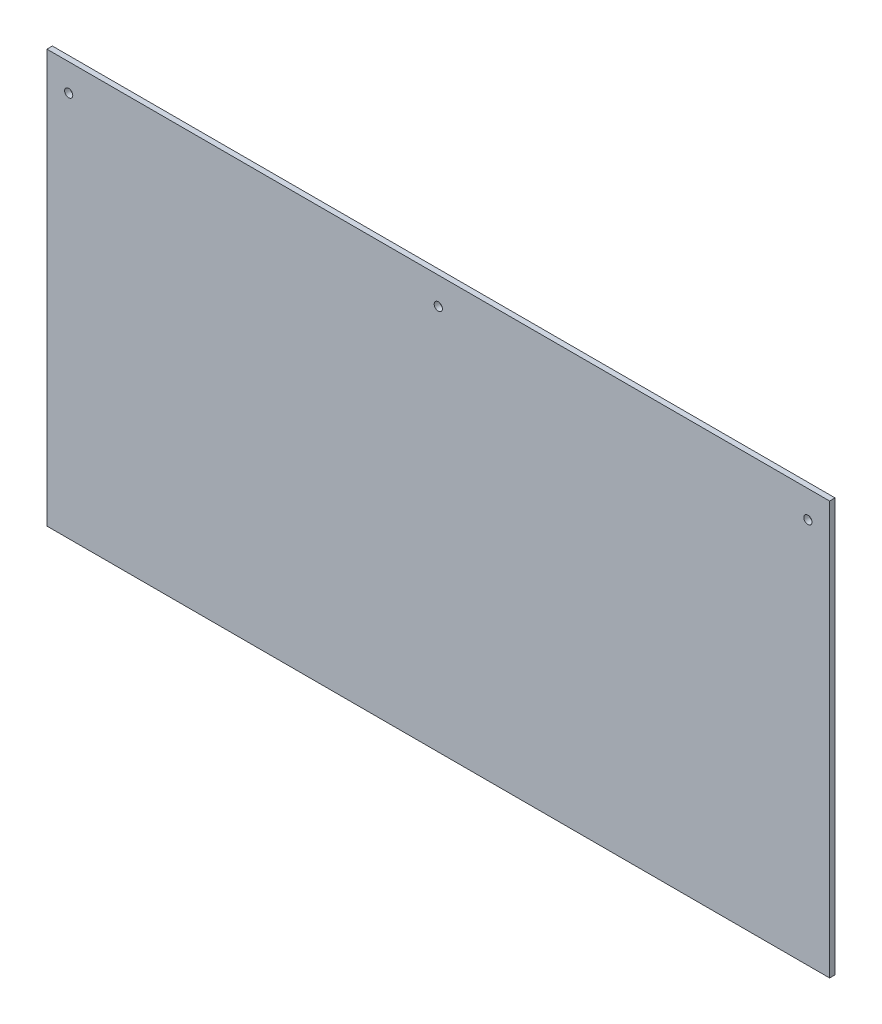
ISO-10303-21;
HEADER;
FILE_DESCRIPTION(('STEP AP214'),'2;1');
FILE_NAME('part.step','',(''),(''),'','','');
FILE_SCHEMA(('AUTOMOTIVE_DESIGN { 1 0 10303 214 1 1 1 1 }'));
ENDSEC;
DATA;
#1=APPLICATION_CONTEXT('core data for automotive mechanical design processes');
#2=APPLICATION_PROTOCOL_DEFINITION('international standard','automotive_design',2000,#1);
#3=PRODUCT_CONTEXT('',#1,'mechanical');
#4=PRODUCT('Part','Part','',(#3));
#5=PRODUCT_RELATED_PRODUCT_CATEGORY('part','',(#4));
#6=PRODUCT_DEFINITION_FORMATION('','',#4);
#7=PRODUCT_DEFINITION_CONTEXT('part definition',#1,'design');
#8=PRODUCT_DEFINITION('design','',#6,#7);
#9=PRODUCT_DEFINITION_SHAPE('','',#8);
#10=(LENGTH_UNIT() NAMED_UNIT(*) SI_UNIT(.MILLI.,.METRE.));
#11=(NAMED_UNIT(*) PLANE_ANGLE_UNIT() SI_UNIT($,.RADIAN.));
#12=(NAMED_UNIT(*) SI_UNIT($,.STERADIAN.) SOLID_ANGLE_UNIT());
#13=UNCERTAINTY_MEASURE_WITH_UNIT(LENGTH_MEASURE(1.E-05),#10,'distance_accuracy_value','');
#14=(GEOMETRIC_REPRESENTATION_CONTEXT(3) GLOBAL_UNCERTAINTY_ASSIGNED_CONTEXT((#13)) GLOBAL_UNIT_ASSIGNED_CONTEXT((#10,
#11,#12)) REPRESENTATION_CONTEXT('',''));
#15=CARTESIAN_POINT('',(0.,0.,0.));
#16=DIRECTION('',(0.,0.,1.));
#17=DIRECTION('',(1.,0.,0.));
#18=AXIS2_PLACEMENT_3D('',#15,#16,#17);
#19=CARTESIAN_POINT('',(889.,450.85,0.));
#20=DIRECTION('',(0.,0.,1.));
#21=DIRECTION('',(1.,0.,0.));
#22=AXIS2_PLACEMENT_3D('',#19,#20,#21);
#23=CYLINDRICAL_SURFACE('',#22,4.7625);
#24=CARTESIAN_POINT('',(889.,450.85,0.));
#25=DIRECTION('',(0.,0.,1.));
#26=DIRECTION('',(1.,0.,0.));
#27=AXIS2_PLACEMENT_3D('',#24,#25,#26);
#28=CIRCLE('',#27,4.7625);
#29=CARTESIAN_POINT('',(893.7625,450.85,0.));
#30=VERTEX_POINT('',#29);
#31=EDGE_CURVE('E40',#30,#30,#28,.T.);
#32=ORIENTED_EDGE('',*,*,#31,.F.);
#33=EDGE_LOOP('',(#32));
#34=FACE_BOUND('',#33,.T.);
#35=CARTESIAN_POINT('',(889.,450.85,6.35));
#36=DIRECTION('',(0.,0.,1.));
#37=DIRECTION('',(1.,0.,0.));
#38=AXIS2_PLACEMENT_3D('',#35,#36,#37);
#39=CIRCLE('',#38,4.7625);
#40=CARTESIAN_POINT('',(893.7625,450.85,6.35));
#41=VERTEX_POINT('',#40);
#42=EDGE_CURVE('E11',#41,#41,#39,.T.);
#43=ORIENTED_EDGE('',*,*,#42,.T.);
#44=EDGE_LOOP('',(#43));
#45=FACE_BOUND('',#44,.T.);
#46=ADVANCED_FACE('F32',(#34,#45),#23,.F.);
#47=CARTESIAN_POINT('',(0.,0.,6.35));
#48=DIRECTION('',(1.,0.,0.));
#49=DIRECTION('',(0.,0.,-1.));
#50=AXIS2_PLACEMENT_3D('',#47,#48,#49);
#51=PLANE('',#50);
#52=DIRECTION('',(0.,-1.,0.));
#53=VECTOR('',#52,1.);
#54=CARTESIAN_POINT('',(0.,0.,0.));
#55=LINE('',#54,#53);
#56=CARTESIAN_POINT('',(0.,482.6,0.));
#57=VERTEX_POINT('',#56);
#58=CARTESIAN_POINT('',(0.,0.,0.));
#59=VERTEX_POINT('',#58);
#60=EDGE_CURVE('E100',#57,#59,#55,.T.);
#61=ORIENTED_EDGE('',*,*,#60,.T.);
#62=DIRECTION('',(0.,0.,-1.));
#63=VECTOR('',#62,1.);
#64=CARTESIAN_POINT('',(0.,0.,6.35));
#65=LINE('',#64,#63);
#66=CARTESIAN_POINT('',(0.,0.,6.35));
#67=VERTEX_POINT('',#66);
#68=EDGE_CURVE('E91',#67,#59,#65,.T.);
#69=ORIENTED_EDGE('',*,*,#68,.F.);
#70=DIRECTION('',(0.,-1.,0.));
#71=VECTOR('',#70,1.);
#72=CARTESIAN_POINT('',(0.,0.,6.35));
#73=LINE('',#72,#71);
#74=CARTESIAN_POINT('',(0.,482.6,6.35));
#75=VERTEX_POINT('',#74);
#76=EDGE_CURVE('E85',#75,#67,#73,.T.);
#77=ORIENTED_EDGE('',*,*,#76,.F.);
#78=DIRECTION('',(0.,0.,-1.));
#79=VECTOR('',#78,1.);
#80=CARTESIAN_POINT('',(0.,482.6,6.35));
#81=LINE('',#80,#79);
#82=EDGE_CURVE('E96',#75,#57,#81,.T.);
#83=ORIENTED_EDGE('',*,*,#82,.T.);
#84=EDGE_LOOP('',(#61,#69,#77,#83));
#85=FACE_BOUND('',#84,.T.);
#86=ADVANCED_FACE('F116',(#85),#51,.F.);
#87=CARTESIAN_POINT('',(0.,0.,6.35));
#88=DIRECTION('',(0.,1.,0.));
#89=DIRECTION('',(0.,0.,1.));
#90=AXIS2_PLACEMENT_3D('',#87,#88,#89);
#91=PLANE('',#90);
#92=DIRECTION('',(1.,0.,0.));
#93=VECTOR('',#92,1.);
#94=CARTESIAN_POINT('',(0.,0.,0.));
#95=LINE('',#94,#93);
#96=CARTESIAN_POINT('',(914.4,0.,0.));
#97=VERTEX_POINT('',#96);
#98=EDGE_CURVE('E90',#59,#97,#95,.T.);
#99=ORIENTED_EDGE('',*,*,#98,.T.);
#100=DIRECTION('',(0.,0.,-1.));
#101=VECTOR('',#100,1.);
#102=CARTESIAN_POINT('',(914.4,0.,6.35));
#103=LINE('',#102,#101);
#104=CARTESIAN_POINT('',(914.4,0.,6.35));
#105=VERTEX_POINT('',#104);
#106=EDGE_CURVE('E88',#105,#97,#103,.T.);
#107=ORIENTED_EDGE('',*,*,#106,.F.);
#108=DIRECTION('',(1.,0.,0.));
#109=VECTOR('',#108,1.);
#110=CARTESIAN_POINT('',(0.,0.,6.35));
#111=LINE('',#110,#109);
#112=EDGE_CURVE('E79',#67,#105,#111,.T.);
#113=ORIENTED_EDGE('',*,*,#112,.F.);
#114=ORIENTED_EDGE('',*,*,#68,.T.);
#115=EDGE_LOOP('',(#99,#107,#113,#114));
#116=FACE_BOUND('',#115,.T.);
#117=ADVANCED_FACE('F89',(#116),#91,.F.);
#118=CARTESIAN_POINT('',(914.4,0.,6.35));
#119=DIRECTION('',(-1.,0.,0.));
#120=DIRECTION('',(0.,0.,1.));
#121=AXIS2_PLACEMENT_3D('',#118,#119,#120);
#122=PLANE('',#121);
#123=DIRECTION('',(0.,1.,0.));
#124=VECTOR('',#123,1.);
#125=CARTESIAN_POINT('',(914.4,0.,0.));
#126=LINE('',#125,#124);
#127=CARTESIAN_POINT('',(914.4,482.6,0.));
#128=VERTEX_POINT('',#127);
#129=EDGE_CURVE('E65',#97,#128,#126,.T.);
#130=ORIENTED_EDGE('',*,*,#129,.T.);
#131=DIRECTION('',(0.,0.,-1.));
#132=VECTOR('',#131,1.);
#133=CARTESIAN_POINT('',(914.4,482.6,6.35));
#134=LINE('',#133,#132);
#135=CARTESIAN_POINT('',(914.4,482.6,6.35));
#136=VERTEX_POINT('',#135);
#137=EDGE_CURVE('E92',#136,#128,#134,.T.);
#138=ORIENTED_EDGE('',*,*,#137,.F.);
#139=DIRECTION('',(0.,1.,0.));
#140=VECTOR('',#139,1.);
#141=CARTESIAN_POINT('',(914.4,0.,6.35));
#142=LINE('',#141,#140);
#143=EDGE_CURVE('E83',#105,#136,#142,.T.);
#144=ORIENTED_EDGE('',*,*,#143,.F.);
#145=ORIENTED_EDGE('',*,*,#106,.T.);
#146=EDGE_LOOP('',(#130,#138,#144,#145));
#147=FACE_BOUND('',#146,.T.);
#148=ADVANCED_FACE('F94',(#147),#122,.F.);
#149=CARTESIAN_POINT('',(0.,482.6,6.35));
#150=DIRECTION('',(0.,-1.,0.));
#151=DIRECTION('',(1.,0.,0.));
#152=AXIS2_PLACEMENT_3D('',#149,#150,#151);
#153=PLANE('',#152);
#154=DIRECTION('',(-1.,0.,0.));
#155=VECTOR('',#154,1.);
#156=CARTESIAN_POINT('',(0.,482.6,0.));
#157=LINE('',#156,#155);
#158=EDGE_CURVE('E71',#128,#57,#157,.T.);
#159=ORIENTED_EDGE('',*,*,#158,.T.);
#160=ORIENTED_EDGE('',*,*,#82,.F.);
#161=DIRECTION('',(-1.,0.,0.));
#162=VECTOR('',#161,1.);
#163=CARTESIAN_POINT('',(0.,482.6,6.35));
#164=LINE('',#163,#162);
#165=EDGE_CURVE('E48',#136,#75,#164,.T.);
#166=ORIENTED_EDGE('',*,*,#165,.F.);
#167=ORIENTED_EDGE('',*,*,#137,.T.);
#168=EDGE_LOOP('',(#159,#160,#166,#167));
#169=FACE_BOUND('',#168,.T.);
#170=ADVANCED_FACE('F119',(#169),#153,.F.);
#171=CARTESIAN_POINT('',(0.,0.,6.35));
#172=DIRECTION('',(0.,0.,-1.));
#173=DIRECTION('',(-1.,0.,0.));
#174=AXIS2_PLACEMENT_3D('',#171,#172,#173);
#175=PLANE('',#174);
#176=CARTESIAN_POINT('',(457.2,450.85,6.35));
#177=DIRECTION('',(0.,0.,1.));
#178=DIRECTION('',(1.,0.,0.));
#179=AXIS2_PLACEMENT_3D('',#176,#177,#178);
#180=CIRCLE('',#179,4.7625);
#181=CARTESIAN_POINT('',(461.9625,450.85,6.35));
#182=VERTEX_POINT('',#181);
#183=EDGE_CURVE('E148',#182,#182,#180,.T.);
#184=ORIENTED_EDGE('',*,*,#183,.F.);
#185=EDGE_LOOP('',(#184));
#186=FACE_BOUND('',#185,.T.);
#187=CARTESIAN_POINT('',(25.4,450.85,6.35));
#188=DIRECTION('',(0.,0.,1.));
#189=DIRECTION('',(1.,0.,0.));
#190=AXIS2_PLACEMENT_3D('',#187,#188,#189);
#191=CIRCLE('',#190,4.7625);
#192=CARTESIAN_POINT('',(30.1625,450.85,6.35));
#193=VERTEX_POINT('',#192);
#194=EDGE_CURVE('E145',#193,#193,#191,.T.);
#195=ORIENTED_EDGE('',*,*,#194,.F.);
#196=EDGE_LOOP('',(#195));
#197=FACE_BOUND('',#196,.T.);
#198=ORIENTED_EDGE('',*,*,#76,.T.);
#199=ORIENTED_EDGE('',*,*,#112,.T.);
#200=ORIENTED_EDGE('',*,*,#143,.T.);
#201=ORIENTED_EDGE('',*,*,#165,.T.);
#202=EDGE_LOOP('',(#198,#199,#200,#201));
#203=FACE_BOUND('',#202,.T.);
#204=ORIENTED_EDGE('',*,*,#42,.F.);
#205=EDGE_LOOP('',(#204));
#206=FACE_BOUND('',#205,.T.);
#207=ADVANCED_FACE('F80',(#186,#197,#203,#206),#175,.F.);
#208=CARTESIAN_POINT('',(0.,0.,0.));
#209=DIRECTION('',(0.,0.,-1.));
#210=DIRECTION('',(-1.,0.,0.));
#211=AXIS2_PLACEMENT_3D('',#208,#209,#210);
#212=PLANE('',#211);
#213=CARTESIAN_POINT('',(457.2,450.85,0.));
#214=DIRECTION('',(0.,0.,1.));
#215=DIRECTION('',(1.,0.,0.));
#216=AXIS2_PLACEMENT_3D('',#213,#214,#215);
#217=CIRCLE('',#216,4.7625);
#218=CARTESIAN_POINT('',(461.9625,450.85,0.));
#219=VERTEX_POINT('',#218);
#220=EDGE_CURVE('E153',#219,#219,#217,.T.);
#221=ORIENTED_EDGE('',*,*,#220,.T.);
#222=EDGE_LOOP('',(#221));
#223=FACE_BOUND('',#222,.T.);
#224=CARTESIAN_POINT('',(25.4,450.85,0.));
#225=DIRECTION('',(0.,0.,1.));
#226=DIRECTION('',(1.,0.,0.));
#227=AXIS2_PLACEMENT_3D('',#224,#225,#226);
#228=CIRCLE('',#227,4.7625);
#229=CARTESIAN_POINT('',(30.1625,450.85,0.));
#230=VERTEX_POINT('',#229);
#231=EDGE_CURVE('E103',#230,#230,#228,.T.);
#232=ORIENTED_EDGE('',*,*,#231,.T.);
#233=EDGE_LOOP('',(#232));
#234=FACE_BOUND('',#233,.T.);
#235=ORIENTED_EDGE('',*,*,#60,.F.);
#236=ORIENTED_EDGE('',*,*,#158,.F.);
#237=ORIENTED_EDGE('',*,*,#129,.F.);
#238=ORIENTED_EDGE('',*,*,#98,.F.);
#239=EDGE_LOOP('',(#235,#236,#237,#238));
#240=FACE_BOUND('',#239,.T.);
#241=ORIENTED_EDGE('',*,*,#31,.T.);
#242=EDGE_LOOP('',(#241));
#243=FACE_BOUND('',#242,.T.);
#244=ADVANCED_FACE('F112',(#223,#234,#240,#243),#212,.T.);
#245=CARTESIAN_POINT('',(25.4,450.85,0.));
#246=DIRECTION('',(0.,0.,1.));
#247=DIRECTION('',(1.,0.,0.));
#248=AXIS2_PLACEMENT_3D('',#245,#246,#247);
#249=CYLINDRICAL_SURFACE('',#248,4.7625);
#250=ORIENTED_EDGE('',*,*,#231,.F.);
#251=EDGE_LOOP('',(#250));
#252=FACE_BOUND('',#251,.T.);
#253=ORIENTED_EDGE('',*,*,#194,.T.);
#254=EDGE_LOOP('',(#253));
#255=FACE_BOUND('',#254,.T.);
#256=ADVANCED_FACE('F126',(#252,#255),#249,.F.);
#257=CARTESIAN_POINT('',(457.2,450.85,0.));
#258=DIRECTION('',(0.,0.,1.));
#259=DIRECTION('',(1.,0.,0.));
#260=AXIS2_PLACEMENT_3D('',#257,#258,#259);
#261=CYLINDRICAL_SURFACE('',#260,4.7625);
#262=ORIENTED_EDGE('',*,*,#220,.F.);
#263=EDGE_LOOP('',(#262));
#264=FACE_BOUND('',#263,.T.);
#265=ORIENTED_EDGE('',*,*,#183,.T.);
#266=EDGE_LOOP('',(#265));
#267=FACE_BOUND('',#266,.T.);
#268=ADVANCED_FACE('F158',(#264,#267),#261,.F.);
#269=CLOSED_SHELL('',(#46,#86,#117,#148,#170,#207,#244,#256,#268));
#270=MANIFOLD_SOLID_BREP('B2',#269);
#271=ADVANCED_BREP_SHAPE_REPRESENTATION('',(#18,#270),#14);
#272=SHAPE_DEFINITION_REPRESENTATION(#9,#271);
ENDSEC;
END-ISO-10303-21;
